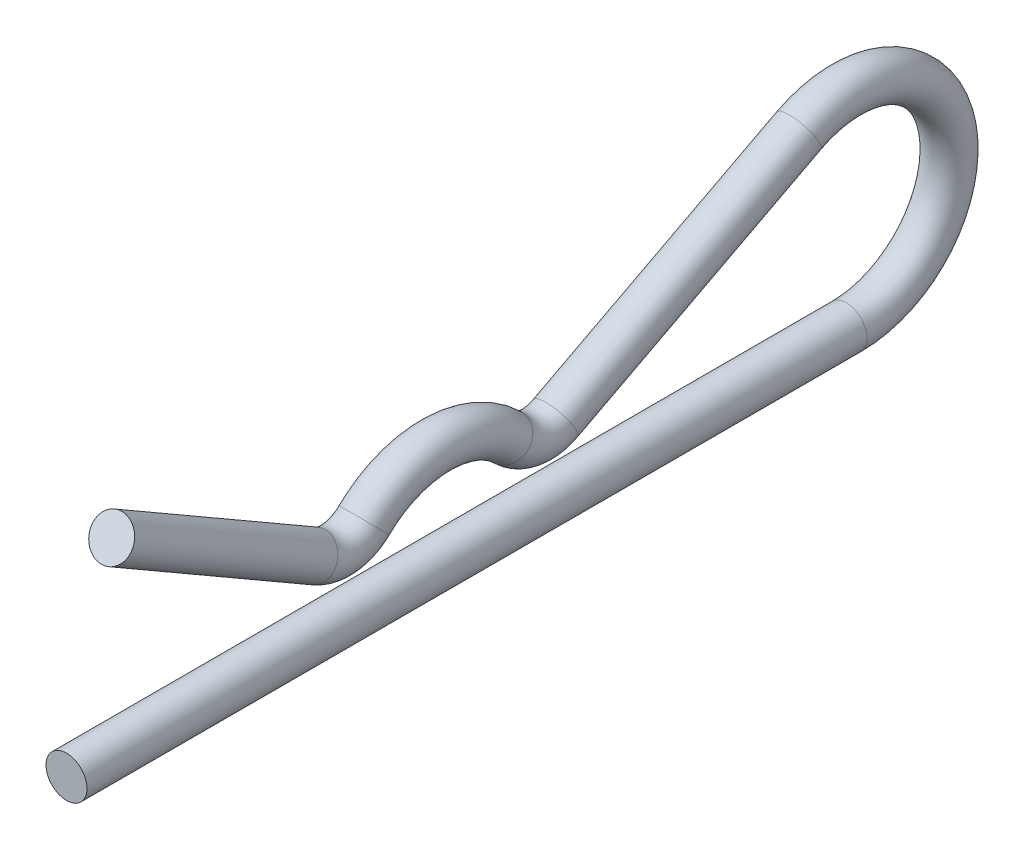
ISO-10303-21;
HEADER;
FILE_DESCRIPTION(('STEP AP214'),'2;1');
FILE_NAME('part.step','',(''),(''),'','','');
FILE_SCHEMA(('AUTOMOTIVE_DESIGN { 1 0 10303 214 1 1 1 1 }'));
ENDSEC;
DATA;
#1=APPLICATION_CONTEXT('core data for automotive mechanical design processes');
#2=APPLICATION_PROTOCOL_DEFINITION('international standard','automotive_design',2000,#1);
#3=PRODUCT_CONTEXT('',#1,'mechanical');
#4=PRODUCT('Part','Part','',(#3));
#5=PRODUCT_RELATED_PRODUCT_CATEGORY('part','',(#4));
#6=PRODUCT_DEFINITION_FORMATION('','',#4);
#7=PRODUCT_DEFINITION_CONTEXT('part definition',#1,'design');
#8=PRODUCT_DEFINITION('design','',#6,#7);
#9=PRODUCT_DEFINITION_SHAPE('','',#8);
#10=(LENGTH_UNIT() NAMED_UNIT(*) SI_UNIT(.MILLI.,.METRE.));
#11=(NAMED_UNIT(*) PLANE_ANGLE_UNIT() SI_UNIT($,.RADIAN.));
#12=(NAMED_UNIT(*) SI_UNIT($,.STERADIAN.) SOLID_ANGLE_UNIT());
#13=UNCERTAINTY_MEASURE_WITH_UNIT(LENGTH_MEASURE(1.E-05),#10,'distance_accuracy_value','');
#14=(GEOMETRIC_REPRESENTATION_CONTEXT(3) GLOBAL_UNCERTAINTY_ASSIGNED_CONTEXT((#13)) GLOBAL_UNIT_ASSIGNED_CONTEXT((#10,
#11,#12)) REPRESENTATION_CONTEXT('',''));
#15=CARTESIAN_POINT('',(0.,0.,0.));
#16=DIRECTION('',(0.,0.,1.));
#17=DIRECTION('',(1.,0.,0.));
#18=AXIS2_PLACEMENT_3D('',#15,#16,#17);
#19=CARTESIAN_POINT('',(0.,2.59393467149221,-9.60518503333166));
#20=DIRECTION('',(0.,0.499999999999991,0.866025403784444));
#21=DIRECTION('',(0.,-0.866025403784444,0.499999999999991));
#22=AXIS2_PLACEMENT_3D('',#19,#20,#21);
#23=CYLINDRICAL_SURFACE('',#22,0.79375);
#24=CARTESIAN_POINT('',(0.,2.59393467149221,-9.60518503333166));
#25=DIRECTION('',(0.,-0.499999999999979,-0.866025403784451));
#26=DIRECTION('',(1.,0.,0.));
#27=AXIS2_PLACEMENT_3D('',#24,#25,#26);
#28=CIRCLE('',#27,0.79375);
#29=CARTESIAN_POINT('',(0.,1.90652700723833,-9.20831003333164));
#30=VERTEX_POINT('',#29);
#31=EDGE_CURVE('E44',#30,#30,#28,.T.);
#32=ORIENTED_EDGE('',*,*,#31,.F.);
#33=EDGE_LOOP('',(#32));
#34=FACE_BOUND('',#33,.T.);
#35=CARTESIAN_POINT('',(0.,7.13129292852995,-1.74624999999988));
#36=DIRECTION('',(0.,-0.499999999999979,-0.866025403784451));
#37=DIRECTION('',(1.,0.,0.));
#38=AXIS2_PLACEMENT_3D('',#35,#36,#37);
#39=CIRCLE('',#38,0.79375);
#40=CARTESIAN_POINT('',(0.793750000000007,7.13129292852995,-1.74624999999988));
#41=VERTEX_POINT('',#40);
#42=EDGE_CURVE('E12',#41,#41,#39,.T.);
#43=ORIENTED_EDGE('',*,*,#42,.T.);
#44=EDGE_LOOP('',(#43));
#45=FACE_BOUND('',#44,.T.);
#46=ADVANCED_FACE('F38',(#34,#45),#23,.T.);
#47=CARTESIAN_POINT('',(0.,3.96875,-10.3989350333317));
#48=DIRECTION('',(-1.,0.,0.));
#49=DIRECTION('',(0.,0.,1.));
#50=AXIS2_PLACEMENT_3D('',#47,#48,#49);
#51=TOROIDAL_SURFACE('',#50,1.58750000000001,0.79375);
#52=CARTESIAN_POINT('',(0.,2.83482142857138,-11.5099535952369));
#53=DIRECTION('',(0.,0.699854212223775,-0.714285714285705));
#54=DIRECTION('',(1.,0.,0.));
#55=AXIS2_PLACEMENT_3D('',#52,#53,#54);
#56=CIRCLE('',#55,0.79375);
#57=CARTESIAN_POINT('',(0.,2.26785714285707,-12.0654628761895));
#58=VERTEX_POINT('',#57);
#59=EDGE_CURVE('E48',#58,#58,#56,.T.);
#60=CARTESIAN_POINT('',(0.,3.96875,-10.3989350333317));
#61=DIRECTION('',(-1.,0.,0.));
#62=DIRECTION('',(0.,0.,1.));
#63=AXIS2_PLACEMENT_3D('',#60,#61,#62);
#64=CIRCLE('',#63,2.38125000000001);
#65=EDGE_CURVE('',#58,#30,#64,.T.);
#66=ORIENTED_EDGE('',*,*,#59,.F.);
#67=ORIENTED_EDGE('',*,*,#31,.T.);
#68=ORIENTED_EDGE('',*,*,#65,.T.);
#69=ORIENTED_EDGE('',*,*,#65,.F.);
#70=EDGE_LOOP('',(#66,#68,#67,#69));
#71=FACE_BOUND('',#70,.T.);
#72=ADVANCED_FACE('F94',(#71),#51,.T.);
#73=CARTESIAN_POINT('',(0.,0.,-14.2875));
#74=DIRECTION('',(1.,0.,0.));
#75=DIRECTION('',(0.,0.,-1.));
#76=AXIS2_PLACEMENT_3D('',#73,#74,#75);
#77=TOROIDAL_SURFACE('',#76,3.96874999999999,0.79375);
#78=CARTESIAN_POINT('',(0.,2.83482142857146,-17.065046404763));
#79=DIRECTION('',(0.,-0.699854212223755,-0.714285714285724));
#80=DIRECTION('',(1.,0.,0.));
#81=AXIS2_PLACEMENT_3D('',#78,#79,#80);
#82=CIRCLE('',#81,0.79375);
#83=CARTESIAN_POINT('',(0.,2.26785714285718,-16.5095371238104));
#84=VERTEX_POINT('',#83);
#85=EDGE_CURVE('E52',#84,#84,#82,.T.);
#86=ORIENTED_EDGE('',*,*,#85,.F.);
#87=EDGE_LOOP('',(#86));
#88=FACE_BOUND('',#87,.T.);
#89=ORIENTED_EDGE('',*,*,#59,.T.);
#90=EDGE_LOOP('',(#89));
#91=FACE_BOUND('',#90,.T.);
#92=ADVANCED_FACE('F88',(#88,#91),#77,.T.);
#93=CARTESIAN_POINT('',(0.,3.96875,-18.1760649666683));
#94=DIRECTION('',(-1.,0.,0.));
#95=DIRECTION('',(0.,0.,1.));
#96=AXIS2_PLACEMENT_3D('',#93,#94,#95);
#97=TOROIDAL_SURFACE('',#96,1.58750000000001,0.79375);
#98=CARTESIAN_POINT('',(0.,2.56210837035598,-18.91194238564));
#99=DIRECTION('',(0.,0.463544830848323,-0.886073467492284));
#100=DIRECTION('',(1.,0.,0.));
#101=AXIS2_PLACEMENT_3D('',#98,#99,#100);
#102=CIRCLE('',#101,0.79375);
#103=CARTESIAN_POINT('',(0.,1.85878755553395,-19.2798810951258));
#104=VERTEX_POINT('',#103);
#105=EDGE_CURVE('E57',#104,#104,#102,.T.);
#106=CARTESIAN_POINT('',(0.,3.96875,-18.1760649666683));
#107=DIRECTION('',(-1.,0.,0.));
#108=DIRECTION('',(0.,0.,1.));
#109=AXIS2_PLACEMENT_3D('',#106,#107,#108);
#110=CIRCLE('',#109,2.38125000000001);
#111=EDGE_CURVE('',#104,#84,#110,.T.);
#112=ORIENTED_EDGE('',*,*,#105,.F.);
#113=ORIENTED_EDGE('',*,*,#85,.T.);
#114=ORIENTED_EDGE('',*,*,#111,.T.);
#115=ORIENTED_EDGE('',*,*,#111,.F.);
#116=EDGE_LOOP('',(#112,#114,#113,#115));
#117=FACE_BOUND('',#116,.T.);
#118=ADVANCED_FACE('F82',(#117),#97,.T.);
#119=CARTESIAN_POINT('',(0.,7.48535407410999,-28.3228064525706));
#120=DIRECTION('',(0.,-0.46354483084831,0.886073467492291));
#121=DIRECTION('',(0.,-0.886073467492291,-0.46354483084831));
#122=AXIS2_PLACEMENT_3D('',#119,#120,#121);
#123=CYLINDRICAL_SURFACE('',#122,0.79375);
#124=CARTESIAN_POINT('',(0.,7.48535407410999,-28.3228064525706));
#125=DIRECTION('',(0.,0.463544830848323,-0.886073467492284));
#126=DIRECTION('',(1.,0.,0.));
#127=AXIS2_PLACEMENT_3D('',#124,#125,#126);
#128=CIRCLE('',#127,0.79375);
#129=CARTESIAN_POINT('',(0.,8.18867488893195,-27.9548677430848));
#130=VERTEX_POINT('',#129);
#131=EDGE_CURVE('E60',#130,#130,#128,.T.);
#132=ORIENTED_EDGE('',*,*,#131,.F.);
#133=EDGE_LOOP('',(#132));
#134=FACE_BOUND('',#133,.T.);
#135=ORIENTED_EDGE('',*,*,#105,.T.);
#136=EDGE_LOOP('',(#135));
#137=FACE_BOUND('',#136,.T.);
#138=ADVANCED_FACE('F76',(#134,#137),#123,.T.);
#139=CARTESIAN_POINT('',(0.,3.96875,-30.1625));
#140=DIRECTION('',(1.,0.,0.));
#141=DIRECTION('',(0.,0.,-1.));
#142=AXIS2_PLACEMENT_3D('',#139,#140,#141);
#143=TOROIDAL_SURFACE('',#142,3.96874999999999,0.79375);
#144=CARTESIAN_POINT('',(0.,0.,-30.1625));
#145=DIRECTION('',(0.,0.,1.));
#146=DIRECTION('',(1.,0.,0.));
#147=AXIS2_PLACEMENT_3D('',#144,#145,#146);
#148=CIRCLE('',#147,0.79375);
#149=CARTESIAN_POINT('',(0.,-0.793749999999996,-30.1625));
#150=VERTEX_POINT('',#149);
#151=EDGE_CURVE('E63',#150,#150,#148,.T.);
#152=CARTESIAN_POINT('',(0.,3.96875,-30.1625));
#153=DIRECTION('',(1.,0.,0.));
#154=DIRECTION('',(0.,0.,-1.));
#155=AXIS2_PLACEMENT_3D('',#152,#153,#154);
#156=CIRCLE('',#155,4.76249999999999);
#157=EDGE_CURVE('',#150,#130,#156,.T.);
#158=ORIENTED_EDGE('',*,*,#151,.F.);
#159=ORIENTED_EDGE('',*,*,#131,.T.);
#160=ORIENTED_EDGE('',*,*,#157,.T.);
#161=ORIENTED_EDGE('',*,*,#157,.F.);
#162=EDGE_LOOP('',(#158,#160,#159,#161));
#163=FACE_BOUND('',#162,.T.);
#164=ADVANCED_FACE('F73',(#163),#143,.T.);
#165=CARTESIAN_POINT('',(0.,0.,-30.1625));
#166=DIRECTION('',(0.,0.,1.));
#167=DIRECTION('',(0.,-1.,0.));
#168=AXIS2_PLACEMENT_3D('',#165,#166,#167);
#169=CYLINDRICAL_SURFACE('',#168,0.79375);
#170=ORIENTED_EDGE('',*,*,#151,.T.);
#171=EDGE_LOOP('',(#170));
#172=FACE_BOUND('',#171,.T.);
#173=CARTESIAN_POINT('',(0.,0.,0.));
#174=DIRECTION('',(0.,0.,1.));
#175=DIRECTION('',(1.,0.,0.));
#176=AXIS2_PLACEMENT_3D('',#173,#174,#175);
#177=CIRCLE('',#176,0.79375);
#178=CARTESIAN_POINT('',(0.79375,0.,0.));
#179=VERTEX_POINT('',#178);
#180=EDGE_CURVE('E64',#179,#179,#177,.T.);
#181=ORIENTED_EDGE('',*,*,#180,.F.);
#182=EDGE_LOOP('',(#181));
#183=FACE_BOUND('',#182,.T.);
#184=ADVANCED_FACE('F70',(#172,#183),#169,.T.);
#185=CARTESIAN_POINT('',(0.,7.13129292852995,-1.74624999999988));
#186=DIRECTION('',(0.,-0.499999999999979,-0.866025403784451));
#187=DIRECTION('',(1.,0.,0.));
#188=AXIS2_PLACEMENT_3D('',#185,#186,#187);
#189=PLANE('',#188);
#190=ORIENTED_EDGE('',*,*,#42,.F.);
#191=EDGE_LOOP('',(#190));
#192=FACE_BOUND('',#191,.T.);
#193=ADVANCED_FACE('F106',(#192),#189,.F.);
#194=CARTESIAN_POINT('',(0.,0.,0.));
#195=DIRECTION('',(0.,0.,1.));
#196=DIRECTION('',(1.,0.,0.));
#197=AXIS2_PLACEMENT_3D('',#194,#195,#196);
#198=PLANE('',#197);
#199=ORIENTED_EDGE('',*,*,#180,.T.);
#200=EDGE_LOOP('',(#199));
#201=FACE_BOUND('',#200,.T.);
#202=ADVANCED_FACE('F107',(#201),#198,.T.);
#203=CLOSED_SHELL('',(#46,#72,#92,#118,#138,#164,#184,#193,#202));
#204=MANIFOLD_SOLID_BREP('B2',#203);
#205=ADVANCED_BREP_SHAPE_REPRESENTATION('',(#18,#204),#14);
#206=SHAPE_DEFINITION_REPRESENTATION(#9,#205);
ENDSEC;
END-ISO-10303-21;
